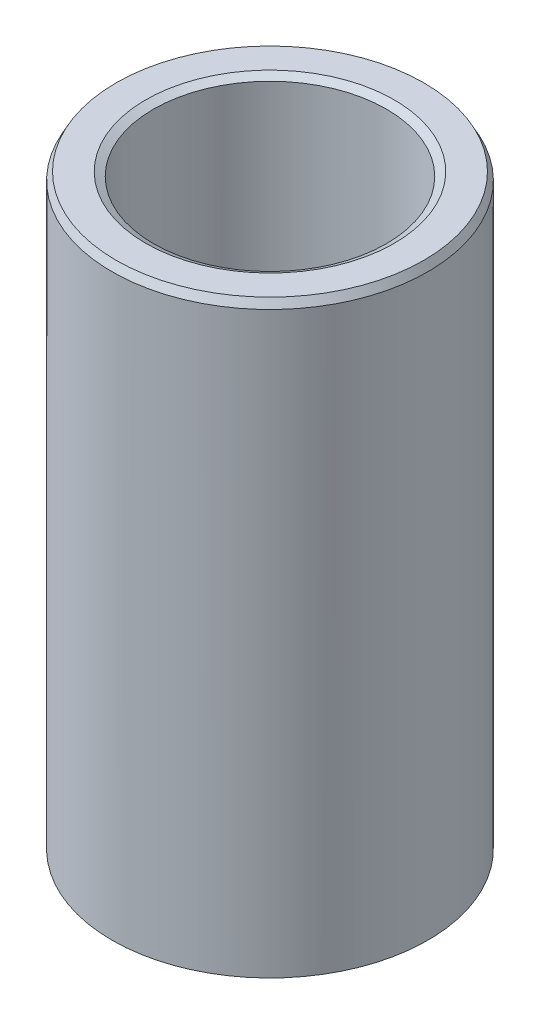
ISO-10303-21;
HEADER;
FILE_DESCRIPTION(('STEP AP214'),'2;1');
FILE_NAME('part.step','',(''),(''),'','','');
FILE_SCHEMA(('AUTOMOTIVE_DESIGN { 1 0 10303 214 1 1 1 1 }'));
ENDSEC;
DATA;
#1=APPLICATION_CONTEXT('core data for automotive mechanical design processes');
#2=APPLICATION_PROTOCOL_DEFINITION('international standard','automotive_design',2000,#1);
#3=PRODUCT_CONTEXT('',#1,'mechanical');
#4=PRODUCT('Part','Part','',(#3));
#5=PRODUCT_RELATED_PRODUCT_CATEGORY('part','',(#4));
#6=PRODUCT_DEFINITION_FORMATION('','',#4);
#7=PRODUCT_DEFINITION_CONTEXT('part definition',#1,'design');
#8=PRODUCT_DEFINITION('design','',#6,#7);
#9=PRODUCT_DEFINITION_SHAPE('','',#8);
#10=(LENGTH_UNIT() NAMED_UNIT(*) SI_UNIT(.MILLI.,.METRE.));
#11=(NAMED_UNIT(*) PLANE_ANGLE_UNIT() SI_UNIT($,.RADIAN.));
#12=(NAMED_UNIT(*) SI_UNIT($,.STERADIAN.) SOLID_ANGLE_UNIT());
#13=UNCERTAINTY_MEASURE_WITH_UNIT(LENGTH_MEASURE(1.E-05),#10,'distance_accuracy_value','');
#14=(GEOMETRIC_REPRESENTATION_CONTEXT(3) GLOBAL_UNCERTAINTY_ASSIGNED_CONTEXT((#13)) GLOBAL_UNIT_ASSIGNED_CONTEXT((#10,
#11,#12)) REPRESENTATION_CONTEXT('',''));
#15=CARTESIAN_POINT('',(0.,0.,0.));
#16=DIRECTION('',(0.,0.,1.));
#17=DIRECTION('',(1.,0.,0.));
#18=AXIS2_PLACEMENT_3D('',#15,#16,#17);
#19=CARTESIAN_POINT('',(0.,121.567854391255,0.));
#20=DIRECTION('',(0.,-1.,0.));
#21=DIRECTION('',(0.,0.,-1.));
#22=AXIS2_PLACEMENT_3D('',#19,#20,#21);
#23=CYLINDRICAL_SURFACE('',#22,32.5);
#24=CARTESIAN_POINT('',(0.,0.857617364434182,0.));
#25=DIRECTION('',(0.,1.,0.));
#26=DIRECTION('',(0.,0.,1.));
#27=AXIS2_PLACEMENT_3D('',#24,#25,#26);
#28=CIRCLE('',#27,32.5);
#29=CARTESIAN_POINT('',(0.,0.857617364434182,-32.5));
#30=VERTEX_POINT('',#29);
#31=EDGE_CURVE('E10',#30,#30,#28,.T.);
#32=CARTESIAN_POINT('',(0.,119.969005116033,0.));
#33=DIRECTION('',(0.,1.,0.));
#34=DIRECTION('',(0.,0.,1.));
#35=AXIS2_PLACEMENT_3D('',#32,#33,#34);
#36=CIRCLE('',#35,32.5);
#37=CARTESIAN_POINT('',(0.,119.969005116033,-32.5));
#38=VERTEX_POINT('',#37);
#39=EDGE_CURVE('E50',#38,#38,#36,.F.);
#40=CARTESIAN_POINT('',(0.,0.857617364434182,-32.5));
#41=CARTESIAN_POINT('',(0.,2.09836098684667,-32.5));
#42=CARTESIAN_POINT('',(0.,3.33910460925915,-32.5));
#43=CARTESIAN_POINT('',(0.,5.82059185408412,-32.5));
#44=CARTESIAN_POINT('',(0.,7.06133547649661,-32.5));
#45=CARTESIAN_POINT('',(0.,9.54282272132158,-32.5));
#46=CARTESIAN_POINT('',(0.,10.7835663437341,-32.5));
#47=CARTESIAN_POINT('',(0.,13.265053588559,-32.5));
#48=CARTESIAN_POINT('',(0.,14.5057972109715,-32.5));
#49=CARTESIAN_POINT('',(0.,16.9872844557965,-32.5));
#50=CARTESIAN_POINT('',(0.,18.228028078209,-32.5));
#51=CARTESIAN_POINT('',(0.,20.7095153230339,-32.5));
#52=CARTESIAN_POINT('',(0.,21.9502589454464,-32.5));
#53=CARTESIAN_POINT('',(0.,24.4317461902714,-32.5));
#54=CARTESIAN_POINT('',(0.,25.6724898126839,-32.5));
#55=CARTESIAN_POINT('',(0.,28.1539770575088,-32.5));
#56=CARTESIAN_POINT('',(0.,29.3947206799213,-32.5));
#57=CARTESIAN_POINT('',(0.,31.8762079247463,-32.5));
#58=CARTESIAN_POINT('',(0.,33.1169515471588,-32.5));
#59=CARTESIAN_POINT('',(0.,35.5984387919838,-32.5));
#60=CARTESIAN_POINT('',(0.,36.8391824143962,-32.5));
#61=CARTESIAN_POINT('',(0.,39.3206696592212,-32.5));
#62=CARTESIAN_POINT('',(0.,40.5614132816337,-32.5));
#63=CARTESIAN_POINT('',(0.,43.0429005264587,-32.5));
#64=CARTESIAN_POINT('',(0.,44.2836441488711,-32.5));
#65=CARTESIAN_POINT('',(0.,46.7651313936961,-32.5));
#66=CARTESIAN_POINT('',(0.,48.0058750161086,-32.5));
#67=CARTESIAN_POINT('',(0.,50.4873622609336,-32.5));
#68=CARTESIAN_POINT('',(0.,51.7281058833461,-32.5));
#69=CARTESIAN_POINT('',(0.,54.209593128171,-32.5));
#70=CARTESIAN_POINT('',(0.,55.4503367505835,-32.5));
#71=CARTESIAN_POINT('',(0.,57.9318239954085,-32.5));
#72=CARTESIAN_POINT('',(0.,59.172567617821,-32.5));
#73=CARTESIAN_POINT('',(0.,61.6540548626459,-32.5));
#74=CARTESIAN_POINT('',(0.,62.8947984850584,-32.5));
#75=CARTESIAN_POINT('',(0.,65.3762857298834,-32.5));
#76=CARTESIAN_POINT('',(0.,66.6170293522959,-32.5));
#77=CARTESIAN_POINT('',(0.,69.0985165971208,-32.5));
#78=CARTESIAN_POINT('',(0.,70.3392602195333,-32.5));
#79=CARTESIAN_POINT('',(0.,72.8207474643583,-32.5));
#80=CARTESIAN_POINT('',(0.,74.0614910867708,-32.5));
#81=CARTESIAN_POINT('',(0.,76.5429783315957,-32.5));
#82=CARTESIAN_POINT('',(0.,77.7837219540082,-32.5));
#83=CARTESIAN_POINT('',(0.,80.2652091988332,-32.5));
#84=CARTESIAN_POINT('',(0.,81.5059528212457,-32.5));
#85=CARTESIAN_POINT('',(0.,83.9874400660707,-32.5));
#86=CARTESIAN_POINT('',(0.,85.2281836884832,-32.5));
#87=CARTESIAN_POINT('',(0.,87.7096709333081,-32.5));
#88=CARTESIAN_POINT('',(0.,88.9504145557206,-32.5));
#89=CARTESIAN_POINT('',(0.,91.4319018005456,-32.5));
#90=CARTESIAN_POINT('',(0.,92.672645422958,-32.5));
#91=CARTESIAN_POINT('',(0.,95.154132667783,-32.5));
#92=CARTESIAN_POINT('',(0.,96.3948762901955,-32.5));
#93=CARTESIAN_POINT('',(0.,98.8763635350205,-32.5));
#94=CARTESIAN_POINT('',(0.,100.117107157433,-32.5));
#95=CARTESIAN_POINT('',(0.,102.598594402258,-32.5));
#96=CARTESIAN_POINT('',(0.,103.83933802467,-32.5));
#97=CARTESIAN_POINT('',(0.,106.320825269495,-32.5));
#98=CARTESIAN_POINT('',(0.,107.561568891908,-32.5));
#99=CARTESIAN_POINT('',(0.,110.043056136733,-32.5));
#100=CARTESIAN_POINT('',(0.,111.283799759145,-32.5));
#101=CARTESIAN_POINT('',(0.,113.76528700397,-32.5));
#102=CARTESIAN_POINT('',(0.,115.006030626383,-32.5));
#103=CARTESIAN_POINT('',(0.,117.487517871208,-32.5));
#104=CARTESIAN_POINT('',(0.,118.72826149362,-32.5));
#105=CARTESIAN_POINT('',(0.,119.969005116033,-32.5));
#106=B_SPLINE_CURVE_WITH_KNOTS('',3,(#40,#41,#42,#43,#44,#45,#46,#47,#48,#49,#50,#51,#52,#53,
#54,#55,#56,#57,#58,#59,#60,#61,#62,#63,#64,#65,#66,#67,#68,#69,#70,#71,#72,#73,#74,#75,#76,#77,
#78,#79,#80,#81,#82,#83,#84,#85,#86,#87,#88,#89,#90,#91,#92,#93,#94,#95,#96,#97,#98,#99,#100,
#101,#102,#103,#104,#105),.UNSPECIFIED.,.F.,.F.,(4,2,2,2,2,2,2,2,2,2,2,2,2,2,2,2,2,2,2,2,2,2,2,
2,2,2,2,2,2,2,2,2,4),(0.,3.72223086723746,7.44446173447491,11.1666926017124,14.8889234689498,
18.6111543361873,22.3333852034247,26.0556160706622,29.7778469378996,33.5000778051371,
37.2223086723746,40.944539539612,44.6667704068495,48.3890012740869,52.1112321413244,
55.8334630085618,59.5556938757993,63.2779247430367,67.0001556102742,70.7223864775116,
74.4446173447491,78.1668482119865,81.889079079224,85.6113099464615,89.3335408136989,
93.0557716809363,96.7780025481738,100.500233415411,104.222464282649,107.944695149886,
111.666926017124,115.389156884361,119.111387751599),.UNSPECIFIED.);
#107=EDGE_CURVE('BSEAM39',#30,#38,#106,.T.);
#108=ORIENTED_EDGE('',*,*,#31,.T.);
#109=ORIENTED_EDGE('',*,*,#39,.T.);
#110=ORIENTED_EDGE('',*,*,#107,.T.);
#111=ORIENTED_EDGE('',*,*,#107,.F.);
#112=EDGE_LOOP('',(#108,#110,#109,#111));
#113=FACE_BOUND('',#112,.T.);
#114=ADVANCED_FACE('F39',(#113),#23,.T.);
#115=CARTESIAN_POINT('',(0.,121.567854391255,0.));
#116=DIRECTION('',(0.,1.,0.));
#117=DIRECTION('',(0.,0.,1.));
#118=AXIS2_PLACEMENT_3D('',#115,#116,#117);
#119=PLANE('',#118);
#120=CARTESIAN_POINT('',(0.,121.567854391255,0.));
#121=DIRECTION('',(0.,1.,0.));
#122=DIRECTION('',(0.,0.,1.));
#123=AXIS2_PLACEMENT_3D('',#120,#121,#122);
#124=CIRCLE('',#123,25.5719504178487);
#125=CARTESIAN_POINT('',(0.,121.567854391255,25.5719504178487));
#126=VERTEX_POINT('',#125);
#127=EDGE_CURVE('E58',#126,#126,#124,.F.);
#128=ORIENTED_EDGE('',*,*,#127,.T.);
#129=EDGE_LOOP('',(#128));
#130=FACE_BOUND('',#129,.T.);
#131=CARTESIAN_POINT('',(0.,121.567854391255,0.));
#132=DIRECTION('',(0.,1.,0.));
#133=DIRECTION('',(0.,0.,1.));
#134=AXIS2_PLACEMENT_3D('',#131,#132,#133);
#135=CIRCLE('',#134,31.6423826355659);
#136=CARTESIAN_POINT('',(0.,121.567854391255,31.6423826355659));
#137=VERTEX_POINT('',#136);
#138=EDGE_CURVE('E61',#137,#137,#135,.T.);
#139=ORIENTED_EDGE('',*,*,#138,.T.);
#140=EDGE_LOOP('',(#139));
#141=FACE_BOUND('',#140,.T.);
#142=ADVANCED_FACE('F88',(#130,#141),#119,.T.);
#143=CARTESIAN_POINT('',(0.,0.,0.));
#144=DIRECTION('',(0.,1.,0.));
#145=DIRECTION('',(0.,0.,1.));
#146=AXIS2_PLACEMENT_3D('',#143,#144,#145);
#147=PLANE('',#146);
#148=CARTESIAN_POINT('',(0.,0.,0.));
#149=DIRECTION('',(0.,1.,0.));
#150=DIRECTION('',(0.,0.,1.));
#151=AXIS2_PLACEMENT_3D('',#148,#149,#150);
#152=CIRCLE('',#151,24.8307185070606);
#153=CARTESIAN_POINT('',(0.,0.,24.8307185070606));
#154=VERTEX_POINT('',#153);
#155=EDGE_CURVE('E51',#154,#154,#152,.T.);
#156=ORIENTED_EDGE('',*,*,#155,.T.);
#157=EDGE_LOOP('',(#156));
#158=FACE_BOUND('',#157,.T.);
#159=CARTESIAN_POINT('',(0.,0.,0.));
#160=DIRECTION('',(0.,1.,0.));
#161=DIRECTION('',(0.,0.,1.));
#162=AXIS2_PLACEMENT_3D('',#159,#160,#161);
#163=CIRCLE('',#162,30.9011507247778);
#164=CARTESIAN_POINT('',(0.,0.,30.9011507247778));
#165=VERTEX_POINT('',#164);
#166=EDGE_CURVE('E54',#165,#165,#163,.F.);
#167=ORIENTED_EDGE('',*,*,#166,.T.);
#168=EDGE_LOOP('',(#167));
#169=FACE_BOUND('',#168,.T.);
#170=ADVANCED_FACE('F83',(#158,#169),#147,.F.);
#171=CARTESIAN_POINT('',(0.,121.567854391255,0.));
#172=DIRECTION('',(0.,-1.,0.));
#173=DIRECTION('',(0.,0.,-1.));
#174=AXIS2_PLACEMENT_3D('',#171,#172,#173);
#175=CYLINDRICAL_SURFACE('',#174,23.9731011426264);
#176=CARTESIAN_POINT('',(0.,120.710237026821,0.));
#177=DIRECTION('',(0.,1.,0.));
#178=DIRECTION('',(0.,0.,1.));
#179=AXIS2_PLACEMENT_3D('',#176,#177,#178);
#180=CIRCLE('',#179,23.9731011426264);
#181=CARTESIAN_POINT('',(0.,120.710237026821,-23.9731011426264));
#182=VERTEX_POINT('',#181);
#183=EDGE_CURVE('E67',#182,#182,#180,.T.);
#184=CARTESIAN_POINT('',(0.,1.59884927522214,0.));
#185=DIRECTION('',(0.,1.,0.));
#186=DIRECTION('',(0.,0.,1.));
#187=AXIS2_PLACEMENT_3D('',#184,#185,#186);
#188=CIRCLE('',#187,23.9731011426264);
#189=CARTESIAN_POINT('',(0.,1.59884927522214,-23.9731011426264));
#190=VERTEX_POINT('',#189);
#191=EDGE_CURVE('E69',#190,#190,#188,.F.);
#192=CARTESIAN_POINT('',(0.,120.710237026821,-23.9731011426264));
#193=CARTESIAN_POINT('',(0.,119.469493404408,-23.9731011426264));
#194=CARTESIAN_POINT('',(0.,118.228749781996,-23.9731011426264));
#195=CARTESIAN_POINT('',(0.,115.747262537171,-23.9731011426264));
#196=CARTESIAN_POINT('',(0.,114.506518914758,-23.9731011426264));
#197=CARTESIAN_POINT('',(0.,112.025031669933,-23.9731011426264));
#198=CARTESIAN_POINT('',(0.,110.784288047521,-23.9731011426264));
#199=CARTESIAN_POINT('',(0.,108.302800802696,-23.9731011426264));
#200=CARTESIAN_POINT('',(0.,107.062057180283,-23.9731011426264));
#201=CARTESIAN_POINT('',(0.,104.580569935458,-23.9731011426264));
#202=CARTESIAN_POINT('',(0.,103.339826313046,-23.9731011426264));
#203=CARTESIAN_POINT('',(0.,100.858339068221,-23.9731011426264));
#204=CARTESIAN_POINT('',(0.,99.6175954458083,-23.9731011426264));
#205=CARTESIAN_POINT('',(0.,97.1361082009834,-23.9731011426264));
#206=CARTESIAN_POINT('',(0.,95.8953645785709,-23.9731011426264));
#207=CARTESIAN_POINT('',(0.,93.4138773337459,-23.9731011426264));
#208=CARTESIAN_POINT('',(0.,92.1731337113334,-23.9731011426264));
#209=CARTESIAN_POINT('',(0.,89.6916464665085,-23.9731011426264));
#210=CARTESIAN_POINT('',(0.,88.450902844096,-23.9731011426264));
#211=CARTESIAN_POINT('',(0.,85.969415599271,-23.9731011426264));
#212=CARTESIAN_POINT('',(0.,84.7286719768586,-23.9731011426264));
#213=CARTESIAN_POINT('',(0.,82.2471847320336,-23.9731011426264));
#214=CARTESIAN_POINT('',(0.,81.0064411096211,-23.9731011426264));
#215=CARTESIAN_POINT('',(0.,78.5249538647961,-23.9731011426264));
#216=CARTESIAN_POINT('',(0.,77.2842102423837,-23.9731011426264));
#217=CARTESIAN_POINT('',(0.,74.8027229975587,-23.9731011426264));
#218=CARTESIAN_POINT('',(0.,73.5619793751462,-23.9731011426264));
#219=CARTESIAN_POINT('',(0.,71.0804921303212,-23.9731011426264));
#220=CARTESIAN_POINT('',(0.,69.8397485079087,-23.9731011426264));
#221=CARTESIAN_POINT('',(0.,67.3582612630838,-23.9731011426264));
#222=CARTESIAN_POINT('',(0.,66.1175176406713,-23.9731011426264));
#223=CARTESIAN_POINT('',(0.,63.6360303958463,-23.9731011426264));
#224=CARTESIAN_POINT('',(0.,62.3952867734338,-23.9731011426264));
#225=CARTESIAN_POINT('',(0.,59.9137995286089,-23.9731011426264));
#226=CARTESIAN_POINT('',(0.,58.6730559061964,-23.9731011426264));
#227=CARTESIAN_POINT('',(0.,56.1915686613714,-23.9731011426264));
#228=CARTESIAN_POINT('',(0.,54.9508250389589,-23.9731011426264));
#229=CARTESIAN_POINT('',(0.,52.469337794134,-23.9731011426264));
#230=CARTESIAN_POINT('',(0.,51.2285941717215,-23.9731011426264));
#231=CARTESIAN_POINT('',(0.,48.7471069268965,-23.9731011426264));
#232=CARTESIAN_POINT('',(0.,47.506363304484,-23.9731011426264));
#233=CARTESIAN_POINT('',(0.,45.0248760596591,-23.9731011426264));
#234=CARTESIAN_POINT('',(0.,43.7841324372466,-23.9731011426264));
#235=CARTESIAN_POINT('',(0.,41.3026451924216,-23.9731011426264));
#236=CARTESIAN_POINT('',(0.,40.0619015700091,-23.9731011426264));
#237=CARTESIAN_POINT('',(0.,37.5804143251842,-23.9731011426264));
#238=CARTESIAN_POINT('',(0.,36.3396707027717,-23.9731011426264));
#239=CARTESIAN_POINT('',(0.,33.8581834579467,-23.9731011426264));
#240=CARTESIAN_POINT('',(0.,32.6174398355342,-23.9731011426264));
#241=CARTESIAN_POINT('',(0.,30.1359525907093,-23.9731011426264));
#242=CARTESIAN_POINT('',(0.,28.8952089682968,-23.9731011426264));
#243=CARTESIAN_POINT('',(0.,26.4137217234718,-23.9731011426264));
#244=CARTESIAN_POINT('',(0.,25.1729781010593,-23.9731011426264));
#245=CARTESIAN_POINT('',(0.,22.6914908562344,-23.9731011426264));
#246=CARTESIAN_POINT('',(0.,21.4507472338219,-23.9731011426264));
#247=CARTESIAN_POINT('',(0.,18.9692599889969,-23.9731011426264));
#248=CARTESIAN_POINT('',(0.,17.7285163665844,-23.9731011426264));
#249=CARTESIAN_POINT('',(0.,15.2470291217595,-23.9731011426264));
#250=CARTESIAN_POINT('',(0.,14.006285499347,-23.9731011426264));
#251=CARTESIAN_POINT('',(0.,11.524798254522,-23.9731011426264));
#252=CARTESIAN_POINT('',(0.,10.2840546321095,-23.9731011426264));
#253=CARTESIAN_POINT('',(0.,7.80256738728456,-23.9731011426264));
#254=CARTESIAN_POINT('',(0.,6.56182376487207,-23.9731011426264));
#255=CARTESIAN_POINT('',(0.,4.0803365200471,-23.9731011426264));
#256=CARTESIAN_POINT('',(0.,2.83959289763462,-23.9731011426264));
#257=CARTESIAN_POINT('',(0.,1.59884927522214,-23.9731011426264));
#258=B_SPLINE_CURVE_WITH_KNOTS('',3,(#192,#193,#194,#195,#196,#197,#198,#199,#200,#201,#202,
#203,#204,#205,#206,#207,#208,#209,#210,#211,#212,#213,#214,#215,#216,#217,#218,#219,#220,#221,
#222,#223,#224,#225,#226,#227,#228,#229,#230,#231,#232,#233,#234,#235,#236,#237,#238,#239,#240,
#241,#242,#243,#244,#245,#246,#247,#248,#249,#250,#251,#252,#253,#254,#255,#256,#257),
.UNSPECIFIED.,.F.,.F.,(4,2,2,2,2,2,2,2,2,2,2,2,2,2,2,2,2,2,2,2,2,2,2,2,2,2,2,2,2,2,2,2,4),(0.,
3.72223086723746,7.44446173447491,11.1666926017124,14.8889234689498,18.6111543361873,
22.3333852034247,26.0556160706622,29.7778469378996,33.5000778051371,37.2223086723745,
40.944539539612,44.6667704068494,48.3890012740869,52.1112321413243,55.8334630085618,
59.5556938757992,63.2779247430367,67.0001556102741,70.7223864775116,74.444617344749,
78.1668482119865,81.8890790792239,85.6113099464614,89.3335408136988,93.0557716809363,
96.7780025481737,100.500233415411,104.222464282649,107.944695149886,111.666926017124,
115.389156884361,119.111387751598),.UNSPECIFIED.);
#259=EDGE_CURVE('BSEAM71',#182,#190,#258,.T.);
#260=ORIENTED_EDGE('',*,*,#183,.T.);
#261=ORIENTED_EDGE('',*,*,#191,.T.);
#262=ORIENTED_EDGE('',*,*,#259,.T.);
#263=ORIENTED_EDGE('',*,*,#259,.F.);
#264=EDGE_LOOP('',(#260,#262,#261,#263));
#265=FACE_BOUND('',#264,.T.);
#266=ADVANCED_FACE('F71',(#265),#175,.F.);
#267=CARTESIAN_POINT('',(0.,120.710237026821,0.));
#268=DIRECTION('',(0.,1.,0.));
#269=DIRECTION('',(0.,0.,1.));
#270=AXIS2_PLACEMENT_3D('',#267,#268,#269);
#271=CONICAL_SURFACE('',#270,23.9731011426264,1.07845711451264);
#272=ORIENTED_EDGE('',*,*,#127,.F.);
#273=EDGE_LOOP('',(#272));
#274=FACE_BOUND('',#273,.T.);
#275=ORIENTED_EDGE('',*,*,#183,.F.);
#276=EDGE_LOOP('',(#275));
#277=FACE_BOUND('',#276,.T.);
#278=ADVANCED_FACE('F77',(#274,#277),#271,.F.);
#279=CARTESIAN_POINT('',(0.,0.,0.));
#280=DIRECTION('',(0.,-1.,0.));
#281=DIRECTION('',(0.,0.,-1.));
#282=AXIS2_PLACEMENT_3D('',#279,#280,#281);
#283=CONICAL_SURFACE('',#282,24.8307185070606,0.492339212282255);
#284=ORIENTED_EDGE('',*,*,#191,.F.);
#285=EDGE_LOOP('',(#284));
#286=FACE_BOUND('',#285,.T.);
#287=ORIENTED_EDGE('',*,*,#155,.F.);
#288=EDGE_LOOP('',(#287));
#289=FACE_BOUND('',#288,.T.);
#290=ADVANCED_FACE('F73',(#286,#289),#283,.F.);
#291=CARTESIAN_POINT('',(0.,0.857617364434182,0.));
#292=DIRECTION('',(0.,1.,0.));
#293=DIRECTION('',(0.,0.,1.));
#294=AXIS2_PLACEMENT_3D('',#291,#292,#293);
#295=CONICAL_SURFACE('',#294,32.5,1.07845711451264);
#296=ORIENTED_EDGE('',*,*,#166,.F.);
#297=EDGE_LOOP('',(#296));
#298=FACE_BOUND('',#297,.T.);
#299=ORIENTED_EDGE('',*,*,#31,.F.);
#300=EDGE_LOOP('',(#299));
#301=FACE_BOUND('',#300,.T.);
#302=ADVANCED_FACE('F76',(#298,#301),#295,.T.);
#303=CARTESIAN_POINT('',(0.,121.567854391255,0.));
#304=DIRECTION('',(0.,-1.,0.));
#305=DIRECTION('',(0.,0.,-1.));
#306=AXIS2_PLACEMENT_3D('',#303,#304,#305);
#307=CONICAL_SURFACE('',#306,31.6423826355659,0.49233921228225);
#308=ORIENTED_EDGE('',*,*,#39,.F.);
#309=EDGE_LOOP('',(#308));
#310=FACE_BOUND('',#309,.T.);
#311=ORIENTED_EDGE('',*,*,#138,.F.);
#312=EDGE_LOOP('',(#311));
#313=FACE_BOUND('',#312,.T.);
#314=ADVANCED_FACE('F45',(#310,#313),#307,.T.);
#315=CLOSED_SHELL('',(#114,#142,#170,#266,#278,#290,#302,#314));
#316=MANIFOLD_SOLID_BREP('B2',#315);
#317=ADVANCED_BREP_SHAPE_REPRESENTATION('',(#18,#316),#14);
#318=SHAPE_DEFINITION_REPRESENTATION(#9,#317);
ENDSEC;
END-ISO-10303-21;
